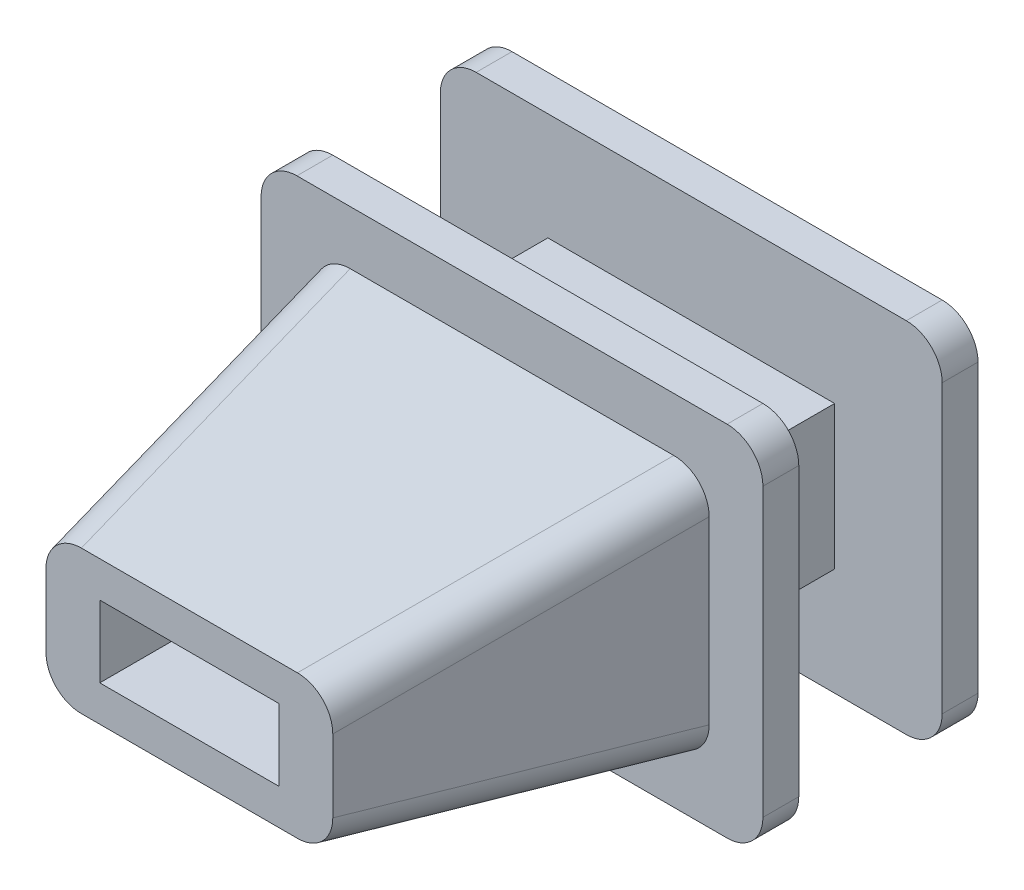
ISO-10303-21;
HEADER;
FILE_DESCRIPTION(('STEP AP214'),'2;1');
FILE_NAME('part.step','',(''),(''),'','','');
FILE_SCHEMA(('AUTOMOTIVE_DESIGN { 1 0 10303 214 1 1 1 1 }'));
ENDSEC;
DATA;
#1=APPLICATION_CONTEXT('core data for automotive mechanical design processes');
#2=APPLICATION_PROTOCOL_DEFINITION('international standard','automotive_design',2000,#1);
#3=PRODUCT_CONTEXT('',#1,'mechanical');
#4=PRODUCT('Part','Part','',(#3));
#5=PRODUCT_RELATED_PRODUCT_CATEGORY('part','',(#4));
#6=PRODUCT_DEFINITION_FORMATION('','',#4);
#7=PRODUCT_DEFINITION_CONTEXT('part definition',#1,'design');
#8=PRODUCT_DEFINITION('design','',#6,#7);
#9=PRODUCT_DEFINITION_SHAPE('','',#8);
#10=(LENGTH_UNIT() NAMED_UNIT(*) SI_UNIT(.MILLI.,.METRE.));
#11=(NAMED_UNIT(*) PLANE_ANGLE_UNIT() SI_UNIT($,.RADIAN.));
#12=(NAMED_UNIT(*) SI_UNIT($,.STERADIAN.) SOLID_ANGLE_UNIT());
#13=UNCERTAINTY_MEASURE_WITH_UNIT(LENGTH_MEASURE(1.E-05),#10,'distance_accuracy_value','');
#14=(GEOMETRIC_REPRESENTATION_CONTEXT(3) GLOBAL_UNCERTAINTY_ASSIGNED_CONTEXT((#13)) GLOBAL_UNIT_ASSIGNED_CONTEXT((#10,
#11,#12)) REPRESENTATION_CONTEXT('',''));
#15=CARTESIAN_POINT('',(0.,0.,0.));
#16=DIRECTION('',(0.,0.,1.));
#17=DIRECTION('',(1.,0.,0.));
#18=AXIS2_PLACEMENT_3D('',#15,#16,#17);
#19=CARTESIAN_POINT('',(-2.,1.,2.));
#20=DIRECTION('',(1.,0.,0.));
#21=DIRECTION('',(0.,1.,0.));
#22=AXIS2_PLACEMENT_3D('',#19,#20,#21);
#23=PLANE('',#22);
#24=DIRECTION('',(0.,-1.,0.));
#25=VECTOR('',#24,1.);
#26=CARTESIAN_POINT('',(-2.,1.,0.));
#27=LINE('',#26,#25);
#28=CARTESIAN_POINT('',(-2.,1.,0.));
#29=VERTEX_POINT('',#28);
#30=CARTESIAN_POINT('',(-2.,-1.,0.));
#31=VERTEX_POINT('',#30);
#32=EDGE_CURVE('E418',#29,#31,#27,.T.);
#33=ORIENTED_EDGE('',*,*,#32,.T.);
#34=DIRECTION('',(0.,0.,-1.));
#35=VECTOR('',#34,1.);
#36=CARTESIAN_POINT('',(-2.,-1.,2.));
#37=LINE('',#36,#35);
#38=CARTESIAN_POINT('',(-2.,-1.,2.));
#39=VERTEX_POINT('',#38);
#40=EDGE_CURVE('E451',#39,#31,#37,.T.);
#41=ORIENTED_EDGE('',*,*,#40,.F.);
#42=DIRECTION('',(0.,-1.,0.));
#43=VECTOR('',#42,1.);
#44=CARTESIAN_POINT('',(-2.,1.,2.));
#45=LINE('',#44,#43);
#46=CARTESIAN_POINT('',(-2.,1.,2.));
#47=VERTEX_POINT('',#46);
#48=EDGE_CURVE('E419',#47,#39,#45,.T.);
#49=ORIENTED_EDGE('',*,*,#48,.F.);
#50=DIRECTION('',(0.,0.,-1.));
#51=VECTOR('',#50,1.);
#52=CARTESIAN_POINT('',(-2.,1.,2.));
#53=LINE('',#52,#51);
#54=EDGE_CURVE('E432',#47,#29,#53,.T.);
#55=ORIENTED_EDGE('',*,*,#54,.T.);
#56=EDGE_LOOP('',(#33,#41,#49,#55));
#57=FACE_BOUND('',#56,.T.);
#58=ADVANCED_FACE('F34',(#57),#23,.F.);
#59=CARTESIAN_POINT('',(-2.,-1.,2.));
#60=DIRECTION('',(0.,1.,0.));
#61=DIRECTION('',(0.,0.,1.));
#62=AXIS2_PLACEMENT_3D('',#59,#60,#61);
#63=PLANE('',#62);
#64=DIRECTION('',(1.,0.,0.));
#65=VECTOR('',#64,1.);
#66=CARTESIAN_POINT('',(-2.,-1.,0.));
#67=LINE('',#66,#65);
#68=CARTESIAN_POINT('',(2.,-1.,0.));
#69=VERTEX_POINT('',#68);
#70=EDGE_CURVE('E435',#31,#69,#67,.T.);
#71=ORIENTED_EDGE('',*,*,#70,.T.);
#72=DIRECTION('',(0.,0.,-1.));
#73=VECTOR('',#72,1.);
#74=CARTESIAN_POINT('',(2.,-1.,2.));
#75=LINE('',#74,#73);
#76=CARTESIAN_POINT('',(2.,-1.,2.));
#77=VERTEX_POINT('',#76);
#78=EDGE_CURVE('E448',#77,#69,#75,.T.);
#79=ORIENTED_EDGE('',*,*,#78,.F.);
#80=DIRECTION('',(1.,0.,0.));
#81=VECTOR('',#80,1.);
#82=CARTESIAN_POINT('',(-2.,-1.,2.));
#83=LINE('',#82,#81);
#84=EDGE_CURVE('E422',#39,#77,#83,.T.);
#85=ORIENTED_EDGE('',*,*,#84,.F.);
#86=ORIENTED_EDGE('',*,*,#40,.T.);
#87=EDGE_LOOP('',(#71,#79,#85,#86));
#88=FACE_BOUND('',#87,.T.);
#89=ADVANCED_FACE('F535',(#88),#63,.F.);
#90=CARTESIAN_POINT('',(2.,1.,2.));
#91=DIRECTION('',(-1.,0.,0.));
#92=DIRECTION('',(0.,-1.,0.));
#93=AXIS2_PLACEMENT_3D('',#90,#91,#92);
#94=PLANE('',#93);
#95=DIRECTION('',(0.,1.,0.));
#96=VECTOR('',#95,1.);
#97=CARTESIAN_POINT('',(2.,1.,0.));
#98=LINE('',#97,#96);
#99=CARTESIAN_POINT('',(2.,1.,0.));
#100=VERTEX_POINT('',#99);
#101=EDGE_CURVE('E438',#69,#100,#98,.T.);
#102=ORIENTED_EDGE('',*,*,#101,.T.);
#103=DIRECTION('',(0.,0.,-1.));
#104=VECTOR('',#103,1.);
#105=CARTESIAN_POINT('',(2.,1.,2.));
#106=LINE('',#105,#104);
#107=CARTESIAN_POINT('',(2.,1.,2.));
#108=VERTEX_POINT('',#107);
#109=EDGE_CURVE('E445',#108,#100,#106,.T.);
#110=ORIENTED_EDGE('',*,*,#109,.F.);
#111=DIRECTION('',(0.,1.,0.));
#112=VECTOR('',#111,1.);
#113=CARTESIAN_POINT('',(2.,1.,2.));
#114=LINE('',#113,#112);
#115=EDGE_CURVE('E426',#77,#108,#114,.T.);
#116=ORIENTED_EDGE('',*,*,#115,.F.);
#117=ORIENTED_EDGE('',*,*,#78,.T.);
#118=EDGE_LOOP('',(#102,#110,#116,#117));
#119=FACE_BOUND('',#118,.T.);
#120=ADVANCED_FACE('F540',(#119),#94,.F.);
#121=CARTESIAN_POINT('',(-2.,1.,2.));
#122=DIRECTION('',(0.,-1.,0.));
#123=DIRECTION('',(0.,0.,-1.));
#124=AXIS2_PLACEMENT_3D('',#121,#122,#123);
#125=PLANE('',#124);
#126=DIRECTION('',(-1.,0.,0.));
#127=VECTOR('',#126,1.);
#128=CARTESIAN_POINT('',(-2.,1.,0.));
#129=LINE('',#128,#127);
#130=EDGE_CURVE('E423',#100,#29,#129,.T.);
#131=ORIENTED_EDGE('',*,*,#130,.T.);
#132=ORIENTED_EDGE('',*,*,#54,.F.);
#133=DIRECTION('',(-1.,0.,0.));
#134=VECTOR('',#133,1.);
#135=CARTESIAN_POINT('',(-2.,1.,2.));
#136=LINE('',#135,#134);
#137=EDGE_CURVE('E429',#108,#47,#136,.T.);
#138=ORIENTED_EDGE('',*,*,#137,.F.);
#139=ORIENTED_EDGE('',*,*,#109,.T.);
#140=EDGE_LOOP('',(#131,#132,#138,#139));
#141=FACE_BOUND('',#140,.T.);
#142=ADVANCED_FACE('F546',(#141),#125,.F.);
#143=CARTESIAN_POINT('',(-3.,-2.,0.));
#144=DIRECTION('',(0.,0.,-1.));
#145=DIRECTION('',(-1.,0.,0.));
#146=AXIS2_PLACEMENT_3D('',#143,#144,#145);
#147=PLANE('',#146);
#148=CARTESIAN_POINT('',(-3.,-2.,0.));
#149=DIRECTION('',(0.,0.,-1.));
#150=DIRECTION('',(-1.,0.,0.));
#151=AXIS2_PLACEMENT_3D('',#148,#149,#150);
#152=CIRCLE('',#151,0.499999999999999);
#153=CARTESIAN_POINT('',(-3.,-2.5,0.));
#154=VERTEX_POINT('',#153);
#155=CARTESIAN_POINT('',(-3.5,-2.,0.));
#156=VERTEX_POINT('',#155);
#157=EDGE_CURVE('E360',#154,#156,#152,.T.);
#158=ORIENTED_EDGE('',*,*,#157,.F.);
#159=DIRECTION('',(-1.,0.,0.));
#160=VECTOR('',#159,1.);
#161=CARTESIAN_POINT('',(3.,-2.5,0.));
#162=LINE('',#161,#160);
#163=CARTESIAN_POINT('',(3.,-2.5,0.));
#164=VERTEX_POINT('',#163);
#165=EDGE_CURVE('E365',#164,#154,#162,.T.);
#166=ORIENTED_EDGE('',*,*,#165,.F.);
#167=CARTESIAN_POINT('',(3.,-2.,0.));
#168=DIRECTION('',(0.,0.,-1.));
#169=DIRECTION('',(1.,0.,0.));
#170=AXIS2_PLACEMENT_3D('',#167,#168,#169);
#171=CIRCLE('',#170,0.499999999999999);
#172=CARTESIAN_POINT('',(3.5,-2.,0.));
#173=VERTEX_POINT('',#172);
#174=EDGE_CURVE('E392',#173,#164,#171,.T.);
#175=ORIENTED_EDGE('',*,*,#174,.F.);
#176=DIRECTION('',(0.,-1.,0.));
#177=VECTOR('',#176,1.);
#178=CARTESIAN_POINT('',(3.5,2.,0.));
#179=LINE('',#178,#177);
#180=CARTESIAN_POINT('',(3.5,2.,0.));
#181=VERTEX_POINT('',#180);
#182=EDGE_CURVE('E390',#181,#173,#179,.T.);
#183=ORIENTED_EDGE('',*,*,#182,.F.);
#184=CARTESIAN_POINT('',(3.,2.,0.));
#185=DIRECTION('',(0.,0.,-1.));
#186=DIRECTION('',(1.,0.,0.));
#187=AXIS2_PLACEMENT_3D('',#184,#185,#186);
#188=CIRCLE('',#187,0.5);
#189=CARTESIAN_POINT('',(3.,2.5,0.));
#190=VERTEX_POINT('',#189);
#191=EDGE_CURVE('E388',#190,#181,#188,.T.);
#192=ORIENTED_EDGE('',*,*,#191,.F.);
#193=DIRECTION('',(1.,0.,0.));
#194=VECTOR('',#193,1.);
#195=CARTESIAN_POINT('',(3.,2.5,0.));
#196=LINE('',#195,#194);
#197=CARTESIAN_POINT('',(-3.,2.5,0.));
#198=VERTEX_POINT('',#197);
#199=EDGE_CURVE('E386',#198,#190,#196,.T.);
#200=ORIENTED_EDGE('',*,*,#199,.F.);
#201=CARTESIAN_POINT('',(-3.,2.,0.));
#202=DIRECTION('',(0.,0.,-1.));
#203=DIRECTION('',(1.,0.,0.));
#204=AXIS2_PLACEMENT_3D('',#201,#202,#203);
#205=CIRCLE('',#204,0.5);
#206=CARTESIAN_POINT('',(-3.5,2.,0.));
#207=VERTEX_POINT('',#206);
#208=EDGE_CURVE('E384',#207,#198,#205,.T.);
#209=ORIENTED_EDGE('',*,*,#208,.F.);
#210=DIRECTION('',(0.,1.,0.));
#211=VECTOR('',#210,1.);
#212=CARTESIAN_POINT('',(-3.5,2.,0.));
#213=LINE('',#212,#211);
#214=EDGE_CURVE('E382',#156,#207,#213,.T.);
#215=ORIENTED_EDGE('',*,*,#214,.F.);
#216=EDGE_LOOP('',(#158,#166,#175,#183,#192,#200,#209,#215));
#217=FACE_BOUND('',#216,.T.);
#218=ORIENTED_EDGE('',*,*,#70,.F.);
#219=ORIENTED_EDGE('',*,*,#32,.F.);
#220=ORIENTED_EDGE('',*,*,#130,.F.);
#221=ORIENTED_EDGE('',*,*,#101,.F.);
#222=EDGE_LOOP('',(#218,#219,#220,#221));
#223=FACE_BOUND('',#222,.T.);
#224=ADVANCED_FACE('F550',(#217,#223),#147,.F.);
#225=CARTESIAN_POINT('',(-3.,-2.,-0.5));
#226=DIRECTION('',(0.,0.,1.));
#227=DIRECTION('',(1.,0.,0.));
#228=AXIS2_PLACEMENT_3D('',#225,#226,#227);
#229=CYLINDRICAL_SURFACE('',#228,0.499999999999999);
#230=ORIENTED_EDGE('',*,*,#157,.T.);
#231=DIRECTION('',(0.,0.,1.));
#232=VECTOR('',#231,1.);
#233=CARTESIAN_POINT('',(-3.5,-2.,-0.5));
#234=LINE('',#233,#232);
#235=CARTESIAN_POINT('',(-3.5,-2.,-0.5));
#236=VERTEX_POINT('',#235);
#237=EDGE_CURVE('E415',#236,#156,#234,.T.);
#238=ORIENTED_EDGE('',*,*,#237,.F.);
#239=CARTESIAN_POINT('',(-3.,-2.,-0.5));
#240=DIRECTION('',(0.,0.,-1.));
#241=DIRECTION('',(-1.,0.,0.));
#242=AXIS2_PLACEMENT_3D('',#239,#240,#241);
#243=CIRCLE('',#242,0.499999999999999);
#244=CARTESIAN_POINT('',(-3.,-2.5,-0.5));
#245=VERTEX_POINT('',#244);
#246=EDGE_CURVE('E361',#245,#236,#243,.T.);
#247=ORIENTED_EDGE('',*,*,#246,.F.);
#248=DIRECTION('',(0.,0.,1.));
#249=VECTOR('',#248,1.);
#250=CARTESIAN_POINT('',(-3.,-2.5,-0.5));
#251=LINE('',#250,#249);
#252=EDGE_CURVE('E379',#245,#154,#251,.T.);
#253=ORIENTED_EDGE('',*,*,#252,.T.);
#254=EDGE_LOOP('',(#230,#238,#247,#253));
#255=FACE_BOUND('',#254,.T.);
#256=ADVANCED_FACE('F552',(#255),#229,.T.);
#257=CARTESIAN_POINT('',(-3.5,2.,-0.5));
#258=DIRECTION('',(1.,0.,0.));
#259=DIRECTION('',(0.,1.,0.));
#260=AXIS2_PLACEMENT_3D('',#257,#258,#259);
#261=PLANE('',#260);
#262=ORIENTED_EDGE('',*,*,#214,.T.);
#263=DIRECTION('',(0.,0.,1.));
#264=VECTOR('',#263,1.);
#265=CARTESIAN_POINT('',(-3.5,2.,-0.5));
#266=LINE('',#265,#264);
#267=CARTESIAN_POINT('',(-3.5,2.,-0.5));
#268=VERTEX_POINT('',#267);
#269=EDGE_CURVE('E412',#268,#207,#266,.T.);
#270=ORIENTED_EDGE('',*,*,#269,.F.);
#271=DIRECTION('',(0.,1.,0.));
#272=VECTOR('',#271,1.);
#273=CARTESIAN_POINT('',(-3.5,2.,-0.5));
#274=LINE('',#273,#272);
#275=EDGE_CURVE('E364',#236,#268,#274,.T.);
#276=ORIENTED_EDGE('',*,*,#275,.F.);
#277=ORIENTED_EDGE('',*,*,#237,.T.);
#278=EDGE_LOOP('',(#262,#270,#276,#277));
#279=FACE_BOUND('',#278,.T.);
#280=ADVANCED_FACE('F555',(#279),#261,.F.);
#281=CARTESIAN_POINT('',(-3.,2.,-0.5));
#282=DIRECTION('',(0.,0.,1.));
#283=DIRECTION('',(1.,0.,0.));
#284=AXIS2_PLACEMENT_3D('',#281,#282,#283);
#285=CYLINDRICAL_SURFACE('',#284,0.5);
#286=ORIENTED_EDGE('',*,*,#208,.T.);
#287=DIRECTION('',(0.,0.,1.));
#288=VECTOR('',#287,1.);
#289=CARTESIAN_POINT('',(-3.,2.5,-0.5));
#290=LINE('',#289,#288);
#291=CARTESIAN_POINT('',(-3.,2.5,-0.5));
#292=VERTEX_POINT('',#291);
#293=EDGE_CURVE('E409',#292,#198,#290,.T.);
#294=ORIENTED_EDGE('',*,*,#293,.F.);
#295=CARTESIAN_POINT('',(-3.,2.,-0.5));
#296=DIRECTION('',(0.,0.,-1.));
#297=DIRECTION('',(1.,0.,0.));
#298=AXIS2_PLACEMENT_3D('',#295,#296,#297);
#299=CIRCLE('',#298,0.5);
#300=EDGE_CURVE('E367',#268,#292,#299,.T.);
#301=ORIENTED_EDGE('',*,*,#300,.F.);
#302=ORIENTED_EDGE('',*,*,#269,.T.);
#303=EDGE_LOOP('',(#286,#294,#301,#302));
#304=FACE_BOUND('',#303,.T.);
#305=ADVANCED_FACE('F559',(#304),#285,.T.);
#306=CARTESIAN_POINT('',(3.,2.5,-0.5));
#307=DIRECTION('',(0.,-1.,0.));
#308=DIRECTION('',(1.,0.,0.));
#309=AXIS2_PLACEMENT_3D('',#306,#307,#308);
#310=PLANE('',#309);
#311=ORIENTED_EDGE('',*,*,#199,.T.);
#312=DIRECTION('',(0.,0.,1.));
#313=VECTOR('',#312,1.);
#314=CARTESIAN_POINT('',(3.,2.5,-0.5));
#315=LINE('',#314,#313);
#316=CARTESIAN_POINT('',(3.,2.5,-0.5));
#317=VERTEX_POINT('',#316);
#318=EDGE_CURVE('E406',#317,#190,#315,.T.);
#319=ORIENTED_EDGE('',*,*,#318,.F.);
#320=DIRECTION('',(1.,0.,0.));
#321=VECTOR('',#320,1.);
#322=CARTESIAN_POINT('',(3.,2.5,-0.5));
#323=LINE('',#322,#321);
#324=EDGE_CURVE('E369',#292,#317,#323,.T.);
#325=ORIENTED_EDGE('',*,*,#324,.F.);
#326=ORIENTED_EDGE('',*,*,#293,.T.);
#327=EDGE_LOOP('',(#311,#319,#325,#326));
#328=FACE_BOUND('',#327,.T.);
#329=ADVANCED_FACE('F563',(#328),#310,.F.);
#330=CARTESIAN_POINT('',(3.,2.,-0.5));
#331=DIRECTION('',(0.,0.,1.));
#332=DIRECTION('',(1.,0.,0.));
#333=AXIS2_PLACEMENT_3D('',#330,#331,#332);
#334=CYLINDRICAL_SURFACE('',#333,0.5);
#335=ORIENTED_EDGE('',*,*,#191,.T.);
#336=DIRECTION('',(0.,0.,1.));
#337=VECTOR('',#336,1.);
#338=CARTESIAN_POINT('',(3.5,2.,-0.5));
#339=LINE('',#338,#337);
#340=CARTESIAN_POINT('',(3.5,2.,-0.5));
#341=VERTEX_POINT('',#340);
#342=EDGE_CURVE('E403',#341,#181,#339,.T.);
#343=ORIENTED_EDGE('',*,*,#342,.F.);
#344=CARTESIAN_POINT('',(3.,2.,-0.5));
#345=DIRECTION('',(0.,0.,-1.));
#346=DIRECTION('',(1.,0.,0.));
#347=AXIS2_PLACEMENT_3D('',#344,#345,#346);
#348=CIRCLE('',#347,0.5);
#349=EDGE_CURVE('E371',#317,#341,#348,.T.);
#350=ORIENTED_EDGE('',*,*,#349,.F.);
#351=ORIENTED_EDGE('',*,*,#318,.T.);
#352=EDGE_LOOP('',(#335,#343,#350,#351));
#353=FACE_BOUND('',#352,.T.);
#354=ADVANCED_FACE('F567',(#353),#334,.T.);
#355=CARTESIAN_POINT('',(3.5,2.,-0.5));
#356=DIRECTION('',(-1.,0.,0.));
#357=DIRECTION('',(0.,-1.,0.));
#358=AXIS2_PLACEMENT_3D('',#355,#356,#357);
#359=PLANE('',#358);
#360=ORIENTED_EDGE('',*,*,#182,.T.);
#361=DIRECTION('',(0.,0.,1.));
#362=VECTOR('',#361,1.);
#363=CARTESIAN_POINT('',(3.5,-2.,-0.5));
#364=LINE('',#363,#362);
#365=CARTESIAN_POINT('',(3.5,-2.,-0.5));
#366=VERTEX_POINT('',#365);
#367=EDGE_CURVE('E400',#366,#173,#364,.T.);
#368=ORIENTED_EDGE('',*,*,#367,.F.);
#369=DIRECTION('',(0.,-1.,0.));
#370=VECTOR('',#369,1.);
#371=CARTESIAN_POINT('',(3.5,2.,-0.5));
#372=LINE('',#371,#370);
#373=EDGE_CURVE('E373',#341,#366,#372,.T.);
#374=ORIENTED_EDGE('',*,*,#373,.F.);
#375=ORIENTED_EDGE('',*,*,#342,.T.);
#376=EDGE_LOOP('',(#360,#368,#374,#375));
#377=FACE_BOUND('',#376,.T.);
#378=ADVANCED_FACE('F571',(#377),#359,.F.);
#379=CARTESIAN_POINT('',(3.,-2.,-0.5));
#380=DIRECTION('',(0.,0.,1.));
#381=DIRECTION('',(1.,0.,0.));
#382=AXIS2_PLACEMENT_3D('',#379,#380,#381);
#383=CYLINDRICAL_SURFACE('',#382,0.499999999999999);
#384=ORIENTED_EDGE('',*,*,#174,.T.);
#385=DIRECTION('',(0.,0.,1.));
#386=VECTOR('',#385,1.);
#387=CARTESIAN_POINT('',(3.,-2.5,-0.5));
#388=LINE('',#387,#386);
#389=CARTESIAN_POINT('',(3.,-2.5,-0.5));
#390=VERTEX_POINT('',#389);
#391=EDGE_CURVE('E397',#390,#164,#388,.T.);
#392=ORIENTED_EDGE('',*,*,#391,.F.);
#393=CARTESIAN_POINT('',(3.,-2.,-0.5));
#394=DIRECTION('',(0.,0.,-1.));
#395=DIRECTION('',(1.,0.,0.));
#396=AXIS2_PLACEMENT_3D('',#393,#394,#395);
#397=CIRCLE('',#396,0.499999999999999);
#398=EDGE_CURVE('E375',#366,#390,#397,.T.);
#399=ORIENTED_EDGE('',*,*,#398,.F.);
#400=ORIENTED_EDGE('',*,*,#367,.T.);
#401=EDGE_LOOP('',(#384,#392,#399,#400));
#402=FACE_BOUND('',#401,.T.);
#403=ADVANCED_FACE('F575',(#402),#383,.T.);
#404=CARTESIAN_POINT('',(3.,-2.5,-0.5));
#405=DIRECTION('',(0.,1.,0.));
#406=DIRECTION('',(0.,0.,1.));
#407=AXIS2_PLACEMENT_3D('',#404,#405,#406);
#408=PLANE('',#407);
#409=ORIENTED_EDGE('',*,*,#165,.T.);
#410=ORIENTED_EDGE('',*,*,#252,.F.);
#411=DIRECTION('',(-1.,0.,0.));
#412=VECTOR('',#411,1.);
#413=CARTESIAN_POINT('',(3.,-2.5,-0.5));
#414=LINE('',#413,#412);
#415=EDGE_CURVE('E377',#390,#245,#414,.T.);
#416=ORIENTED_EDGE('',*,*,#415,.F.);
#417=ORIENTED_EDGE('',*,*,#391,.T.);
#418=EDGE_LOOP('',(#409,#410,#416,#417));
#419=FACE_BOUND('',#418,.T.);
#420=ADVANCED_FACE('F579',(#419),#408,.F.);
#421=CARTESIAN_POINT('',(-3.,-2.,-0.5));
#422=DIRECTION('',(0.,0.,-1.));
#423=DIRECTION('',(-1.,0.,0.));
#424=AXIS2_PLACEMENT_3D('',#421,#422,#423);
#425=PLANE('',#424);
#426=DIRECTION('',(0.,-1.,0.));
#427=VECTOR('',#426,1.);
#428=CARTESIAN_POINT('',(-1.25,0.5,-0.5));
#429=LINE('',#428,#427);
#430=CARTESIAN_POINT('',(-1.25,0.5,-0.5));
#431=VERTEX_POINT('',#430);
#432=CARTESIAN_POINT('',(-1.25,-0.5,-0.5));
#433=VERTEX_POINT('',#432);
#434=EDGE_CURVE('E244',#431,#433,#429,.T.);
#435=ORIENTED_EDGE('',*,*,#434,.T.);
#436=DIRECTION('',(1.,0.,0.));
#437=VECTOR('',#436,1.);
#438=CARTESIAN_POINT('',(-1.25,-0.5,-0.5));
#439=LINE('',#438,#437);
#440=CARTESIAN_POINT('',(1.25,-0.5,-0.5));
#441=VERTEX_POINT('',#440);
#442=EDGE_CURVE('E253',#433,#441,#439,.T.);
#443=ORIENTED_EDGE('',*,*,#442,.T.);
#444=DIRECTION('',(0.,1.,0.));
#445=VECTOR('',#444,1.);
#446=CARTESIAN_POINT('',(1.25,0.5,-0.5));
#447=LINE('',#446,#445);
#448=CARTESIAN_POINT('',(1.25,0.5,-0.5));
#449=VERTEX_POINT('',#448);
#450=EDGE_CURVE('E49',#441,#449,#447,.T.);
#451=ORIENTED_EDGE('',*,*,#450,.T.);
#452=DIRECTION('',(-1.,0.,0.));
#453=VECTOR('',#452,1.);
#454=CARTESIAN_POINT('',(-1.25,0.5,-0.5));
#455=LINE('',#454,#453);
#456=EDGE_CURVE('E250',#449,#431,#455,.T.);
#457=ORIENTED_EDGE('',*,*,#456,.T.);
#458=EDGE_LOOP('',(#435,#443,#451,#457));
#459=FACE_BOUND('',#458,.T.);
#460=ORIENTED_EDGE('',*,*,#246,.T.);
#461=ORIENTED_EDGE('',*,*,#275,.T.);
#462=ORIENTED_EDGE('',*,*,#300,.T.);
#463=ORIENTED_EDGE('',*,*,#324,.T.);
#464=ORIENTED_EDGE('',*,*,#349,.T.);
#465=ORIENTED_EDGE('',*,*,#373,.T.);
#466=ORIENTED_EDGE('',*,*,#398,.T.);
#467=ORIENTED_EDGE('',*,*,#415,.T.);
#468=EDGE_LOOP('',(#460,#461,#462,#463,#464,#465,#466,#467));
#469=FACE_BOUND('',#468,.T.);
#470=ADVANCED_FACE('F257',(#459,#469),#425,.T.);
#471=CARTESIAN_POINT('',(-3.,-2.,2.));
#472=DIRECTION('',(0.,0.,1.));
#473=DIRECTION('',(1.,0.,0.));
#474=AXIS2_PLACEMENT_3D('',#471,#472,#473);
#475=PLANE('',#474);
#476=CARTESIAN_POINT('',(-3.,-2.,2.));
#477=DIRECTION('',(0.,0.,1.));
#478=DIRECTION('',(1.,0.,0.));
#479=AXIS2_PLACEMENT_3D('',#476,#477,#478);
#480=CIRCLE('',#479,0.499999999999999);
#481=CARTESIAN_POINT('',(-3.5,-2.,2.));
#482=VERTEX_POINT('',#481);
#483=CARTESIAN_POINT('',(-3.,-2.5,2.));
#484=VERTEX_POINT('',#483);
#485=EDGE_CURVE('E290',#482,#484,#480,.T.);
#486=ORIENTED_EDGE('',*,*,#485,.F.);
#487=DIRECTION('',(0.,-1.,0.));
#488=VECTOR('',#487,1.);
#489=CARTESIAN_POINT('',(-3.5,2.,2.));
#490=LINE('',#489,#488);
#491=CARTESIAN_POINT('',(-3.5,2.,2.));
#492=VERTEX_POINT('',#491);
#493=EDGE_CURVE('E307',#492,#482,#490,.T.);
#494=ORIENTED_EDGE('',*,*,#493,.F.);
#495=CARTESIAN_POINT('',(-3.,2.,2.));
#496=DIRECTION('',(0.,0.,1.));
#497=DIRECTION('',(1.,0.,0.));
#498=AXIS2_PLACEMENT_3D('',#495,#496,#497);
#499=CIRCLE('',#498,0.5);
#500=CARTESIAN_POINT('',(-3.,2.5,2.));
#501=VERTEX_POINT('',#500);
#502=EDGE_CURVE('E334',#501,#492,#499,.T.);
#503=ORIENTED_EDGE('',*,*,#502,.F.);
#504=DIRECTION('',(-1.,0.,0.));
#505=VECTOR('',#504,1.);
#506=CARTESIAN_POINT('',(3.,2.5,2.));
#507=LINE('',#506,#505);
#508=CARTESIAN_POINT('',(3.,2.5,2.));
#509=VERTEX_POINT('',#508);
#510=EDGE_CURVE('E332',#509,#501,#507,.T.);
#511=ORIENTED_EDGE('',*,*,#510,.F.);
#512=CARTESIAN_POINT('',(3.,2.,2.));
#513=DIRECTION('',(0.,0.,1.));
#514=DIRECTION('',(1.,0.,0.));
#515=AXIS2_PLACEMENT_3D('',#512,#513,#514);
#516=CIRCLE('',#515,0.5);
#517=CARTESIAN_POINT('',(3.5,2.,2.));
#518=VERTEX_POINT('',#517);
#519=EDGE_CURVE('E330',#518,#509,#516,.T.);
#520=ORIENTED_EDGE('',*,*,#519,.F.);
#521=DIRECTION('',(0.,1.,0.));
#522=VECTOR('',#521,1.);
#523=CARTESIAN_POINT('',(3.5,-2.,2.));
#524=LINE('',#523,#522);
#525=CARTESIAN_POINT('',(3.5,-2.,2.));
#526=VERTEX_POINT('',#525);
#527=EDGE_CURVE('E328',#526,#518,#524,.T.);
#528=ORIENTED_EDGE('',*,*,#527,.F.);
#529=CARTESIAN_POINT('',(3.,-2.,2.));
#530=DIRECTION('',(0.,0.,1.));
#531=DIRECTION('',(1.,0.,0.));
#532=AXIS2_PLACEMENT_3D('',#529,#530,#531);
#533=CIRCLE('',#532,0.499999999999999);
#534=CARTESIAN_POINT('',(3.,-2.5,2.));
#535=VERTEX_POINT('',#534);
#536=EDGE_CURVE('E326',#535,#526,#533,.T.);
#537=ORIENTED_EDGE('',*,*,#536,.F.);
#538=DIRECTION('',(1.,0.,0.));
#539=VECTOR('',#538,1.);
#540=CARTESIAN_POINT('',(-3.,-2.5,2.));
#541=LINE('',#540,#539);
#542=EDGE_CURVE('E324',#484,#535,#541,.T.);
#543=ORIENTED_EDGE('',*,*,#542,.F.);
#544=EDGE_LOOP('',(#486,#494,#503,#511,#520,#528,#537,#543));
#545=FACE_BOUND('',#544,.T.);
#546=ORIENTED_EDGE('',*,*,#137,.T.);
#547=ORIENTED_EDGE('',*,*,#48,.T.);
#548=ORIENTED_EDGE('',*,*,#84,.T.);
#549=ORIENTED_EDGE('',*,*,#115,.T.);
#550=EDGE_LOOP('',(#546,#547,#548,#549));
#551=FACE_BOUND('',#550,.T.);
#552=ADVANCED_FACE('F589',(#545,#551),#475,.F.);
#553=CARTESIAN_POINT('',(-3.,-2.,2.5));
#554=DIRECTION('',(0.,0.,-1.));
#555=DIRECTION('',(-1.,0.,0.));
#556=AXIS2_PLACEMENT_3D('',#553,#554,#555);
#557=CYLINDRICAL_SURFACE('',#556,0.499999999999999);
#558=ORIENTED_EDGE('',*,*,#485,.T.);
#559=DIRECTION('',(0.,0.,-1.));
#560=VECTOR('',#559,1.);
#561=CARTESIAN_POINT('',(-3.,-2.5,2.5));
#562=LINE('',#561,#560);
#563=CARTESIAN_POINT('',(-3.,-2.5,2.5));
#564=VERTEX_POINT('',#563);
#565=EDGE_CURVE('E357',#564,#484,#562,.T.);
#566=ORIENTED_EDGE('',*,*,#565,.F.);
#567=CARTESIAN_POINT('',(-3.,-2.,2.5));
#568=DIRECTION('',(0.,0.,1.));
#569=DIRECTION('',(1.,0.,0.));
#570=AXIS2_PLACEMENT_3D('',#567,#568,#569);
#571=CIRCLE('',#570,0.499999999999999);
#572=CARTESIAN_POINT('',(-3.5,-2.,2.5));
#573=VERTEX_POINT('',#572);
#574=EDGE_CURVE('E303',#573,#564,#571,.T.);
#575=ORIENTED_EDGE('',*,*,#574,.F.);
#576=DIRECTION('',(0.,0.,-1.));
#577=VECTOR('',#576,1.);
#578=CARTESIAN_POINT('',(-3.5,-2.,2.5));
#579=LINE('',#578,#577);
#580=EDGE_CURVE('E321',#573,#482,#579,.T.);
#581=ORIENTED_EDGE('',*,*,#580,.T.);
#582=EDGE_LOOP('',(#558,#566,#575,#581));
#583=FACE_BOUND('',#582,.T.);
#584=ADVANCED_FACE('F590',(#583),#557,.T.);
#585=CARTESIAN_POINT('',(-3.,-2.5,2.5));
#586=DIRECTION('',(0.,1.,0.));
#587=DIRECTION('',(0.,0.,1.));
#588=AXIS2_PLACEMENT_3D('',#585,#586,#587);
#589=PLANE('',#588);
#590=ORIENTED_EDGE('',*,*,#542,.T.);
#591=DIRECTION('',(0.,0.,-1.));
#592=VECTOR('',#591,1.);
#593=CARTESIAN_POINT('',(3.,-2.5,2.5));
#594=LINE('',#593,#592);
#595=CARTESIAN_POINT('',(3.,-2.5,2.5));
#596=VERTEX_POINT('',#595);
#597=EDGE_CURVE('E354',#596,#535,#594,.T.);
#598=ORIENTED_EDGE('',*,*,#597,.F.);
#599=DIRECTION('',(1.,0.,0.));
#600=VECTOR('',#599,1.);
#601=CARTESIAN_POINT('',(-3.,-2.5,2.5));
#602=LINE('',#601,#600);
#603=EDGE_CURVE('E306',#564,#596,#602,.T.);
#604=ORIENTED_EDGE('',*,*,#603,.F.);
#605=ORIENTED_EDGE('',*,*,#565,.T.);
#606=EDGE_LOOP('',(#590,#598,#604,#605));
#607=FACE_BOUND('',#606,.T.);
#608=ADVANCED_FACE('F593',(#607),#589,.F.);
#609=CARTESIAN_POINT('',(3.,-2.,2.5));
#610=DIRECTION('',(0.,0.,-1.));
#611=DIRECTION('',(-1.,0.,0.));
#612=AXIS2_PLACEMENT_3D('',#609,#610,#611);
#613=CYLINDRICAL_SURFACE('',#612,0.499999999999999);
#614=ORIENTED_EDGE('',*,*,#536,.T.);
#615=DIRECTION('',(0.,0.,-1.));
#616=VECTOR('',#615,1.);
#617=CARTESIAN_POINT('',(3.5,-2.,2.5));
#618=LINE('',#617,#616);
#619=CARTESIAN_POINT('',(3.5,-2.,2.5));
#620=VERTEX_POINT('',#619);
#621=EDGE_CURVE('E351',#620,#526,#618,.T.);
#622=ORIENTED_EDGE('',*,*,#621,.F.);
#623=CARTESIAN_POINT('',(3.,-2.,2.5));
#624=DIRECTION('',(0.,0.,1.));
#625=DIRECTION('',(1.,0.,0.));
#626=AXIS2_PLACEMENT_3D('',#623,#624,#625);
#627=CIRCLE('',#626,0.499999999999999);
#628=EDGE_CURVE('E309',#596,#620,#627,.T.);
#629=ORIENTED_EDGE('',*,*,#628,.F.);
#630=ORIENTED_EDGE('',*,*,#597,.T.);
#631=EDGE_LOOP('',(#614,#622,#629,#630));
#632=FACE_BOUND('',#631,.T.);
#633=ADVANCED_FACE('F597',(#632),#613,.T.);
#634=CARTESIAN_POINT('',(3.5,-2.,2.5));
#635=DIRECTION('',(-1.,0.,0.));
#636=DIRECTION('',(0.,-1.,0.));
#637=AXIS2_PLACEMENT_3D('',#634,#635,#636);
#638=PLANE('',#637);
#639=ORIENTED_EDGE('',*,*,#527,.T.);
#640=DIRECTION('',(0.,0.,-1.));
#641=VECTOR('',#640,1.);
#642=CARTESIAN_POINT('',(3.5,2.,2.5));
#643=LINE('',#642,#641);
#644=CARTESIAN_POINT('',(3.5,2.,2.5));
#645=VERTEX_POINT('',#644);
#646=EDGE_CURVE('E348',#645,#518,#643,.T.);
#647=ORIENTED_EDGE('',*,*,#646,.F.);
#648=DIRECTION('',(0.,1.,0.));
#649=VECTOR('',#648,1.);
#650=CARTESIAN_POINT('',(3.5,-2.,2.5));
#651=LINE('',#650,#649);
#652=EDGE_CURVE('E311',#620,#645,#651,.T.);
#653=ORIENTED_EDGE('',*,*,#652,.F.);
#654=ORIENTED_EDGE('',*,*,#621,.T.);
#655=EDGE_LOOP('',(#639,#647,#653,#654));
#656=FACE_BOUND('',#655,.T.);
#657=ADVANCED_FACE('F601',(#656),#638,.F.);
#658=CARTESIAN_POINT('',(3.,2.,2.5));
#659=DIRECTION('',(0.,0.,-1.));
#660=DIRECTION('',(-1.,0.,0.));
#661=AXIS2_PLACEMENT_3D('',#658,#659,#660);
#662=CYLINDRICAL_SURFACE('',#661,0.5);
#663=ORIENTED_EDGE('',*,*,#519,.T.);
#664=DIRECTION('',(0.,0.,-1.));
#665=VECTOR('',#664,1.);
#666=CARTESIAN_POINT('',(3.,2.5,2.5));
#667=LINE('',#666,#665);
#668=CARTESIAN_POINT('',(3.,2.5,2.5));
#669=VERTEX_POINT('',#668);
#670=EDGE_CURVE('E345',#669,#509,#667,.T.);
#671=ORIENTED_EDGE('',*,*,#670,.F.);
#672=CARTESIAN_POINT('',(3.,2.,2.5));
#673=DIRECTION('',(0.,0.,1.));
#674=DIRECTION('',(1.,0.,0.));
#675=AXIS2_PLACEMENT_3D('',#672,#673,#674);
#676=CIRCLE('',#675,0.5);
#677=EDGE_CURVE('E313',#645,#669,#676,.T.);
#678=ORIENTED_EDGE('',*,*,#677,.F.);
#679=ORIENTED_EDGE('',*,*,#646,.T.);
#680=EDGE_LOOP('',(#663,#671,#678,#679));
#681=FACE_BOUND('',#680,.T.);
#682=ADVANCED_FACE('F605',(#681),#662,.T.);
#683=CARTESIAN_POINT('',(3.,2.5,2.5));
#684=DIRECTION('',(0.,-1.,0.));
#685=DIRECTION('',(1.,0.,0.));
#686=AXIS2_PLACEMENT_3D('',#683,#684,#685);
#687=PLANE('',#686);
#688=ORIENTED_EDGE('',*,*,#510,.T.);
#689=DIRECTION('',(0.,0.,-1.));
#690=VECTOR('',#689,1.);
#691=CARTESIAN_POINT('',(-3.,2.5,2.5));
#692=LINE('',#691,#690);
#693=CARTESIAN_POINT('',(-3.,2.5,2.5));
#694=VERTEX_POINT('',#693);
#695=EDGE_CURVE('E342',#694,#501,#692,.T.);
#696=ORIENTED_EDGE('',*,*,#695,.F.);
#697=DIRECTION('',(-1.,0.,0.));
#698=VECTOR('',#697,1.);
#699=CARTESIAN_POINT('',(3.,2.5,2.5));
#700=LINE('',#699,#698);
#701=EDGE_CURVE('E315',#669,#694,#700,.T.);
#702=ORIENTED_EDGE('',*,*,#701,.F.);
#703=ORIENTED_EDGE('',*,*,#670,.T.);
#704=EDGE_LOOP('',(#688,#696,#702,#703));
#705=FACE_BOUND('',#704,.T.);
#706=ADVANCED_FACE('F609',(#705),#687,.F.);
#707=CARTESIAN_POINT('',(-3.,2.,2.5));
#708=DIRECTION('',(0.,0.,-1.));
#709=DIRECTION('',(-1.,0.,0.));
#710=AXIS2_PLACEMENT_3D('',#707,#708,#709);
#711=CYLINDRICAL_SURFACE('',#710,0.5);
#712=ORIENTED_EDGE('',*,*,#502,.T.);
#713=DIRECTION('',(0.,0.,-1.));
#714=VECTOR('',#713,1.);
#715=CARTESIAN_POINT('',(-3.5,2.,2.5));
#716=LINE('',#715,#714);
#717=CARTESIAN_POINT('',(-3.5,2.,2.5));
#718=VERTEX_POINT('',#717);
#719=EDGE_CURVE('E339',#718,#492,#716,.T.);
#720=ORIENTED_EDGE('',*,*,#719,.F.);
#721=CARTESIAN_POINT('',(-3.,2.,2.5));
#722=DIRECTION('',(0.,0.,1.));
#723=DIRECTION('',(1.,0.,0.));
#724=AXIS2_PLACEMENT_3D('',#721,#722,#723);
#725=CIRCLE('',#724,0.5);
#726=EDGE_CURVE('E317',#694,#718,#725,.T.);
#727=ORIENTED_EDGE('',*,*,#726,.F.);
#728=ORIENTED_EDGE('',*,*,#695,.T.);
#729=EDGE_LOOP('',(#712,#720,#727,#728));
#730=FACE_BOUND('',#729,.T.);
#731=ADVANCED_FACE('F613',(#730),#711,.T.);
#732=CARTESIAN_POINT('',(-3.5,2.,2.5));
#733=DIRECTION('',(1.,0.,0.));
#734=DIRECTION('',(0.,1.,0.));
#735=AXIS2_PLACEMENT_3D('',#732,#733,#734);
#736=PLANE('',#735);
#737=ORIENTED_EDGE('',*,*,#493,.T.);
#738=ORIENTED_EDGE('',*,*,#580,.F.);
#739=DIRECTION('',(0.,-1.,0.));
#740=VECTOR('',#739,1.);
#741=CARTESIAN_POINT('',(-3.5,2.,2.5));
#742=LINE('',#741,#740);
#743=EDGE_CURVE('E319',#718,#573,#742,.T.);
#744=ORIENTED_EDGE('',*,*,#743,.F.);
#745=ORIENTED_EDGE('',*,*,#719,.T.);
#746=EDGE_LOOP('',(#737,#738,#744,#745));
#747=FACE_BOUND('',#746,.T.);
#748=ADVANCED_FACE('F617',(#747),#736,.F.);
#749=CARTESIAN_POINT('',(-3.,-2.,2.5));
#750=DIRECTION('',(0.,0.,1.));
#751=DIRECTION('',(1.,0.,0.));
#752=AXIS2_PLACEMENT_3D('',#749,#750,#751);
#753=PLANE('',#752);
#754=DIRECTION('',(0.,-1.,0.));
#755=VECTOR('',#754,1.);
#756=CARTESIAN_POINT('',(-2.75,1.75,2.5));
#757=LINE('',#756,#755);
#758=CARTESIAN_POINT('',(-2.75,1.25680303808393,2.5));
#759=VERTEX_POINT('',#758);
#760=CARTESIAN_POINT('',(-2.75,-1.25680303808393,2.5));
#761=VERTEX_POINT('',#760);
#762=EDGE_CURVE('E283',#759,#761,#757,.T.);
#763=ORIENTED_EDGE('',*,*,#762,.F.);
#764=CARTESIAN_POINT('',(-2.24310312247515,1.24310312247515,2.5));
#765=DIRECTION('',(0.,0.,1.));
#766=DIRECTION('',(0.707106781186548,-0.707106781186547,0.));
#767=AXIS2_PLACEMENT_3D('',#764,#765,#766);
#768=ELLIPSE('',#767,0.513701166914081,0.5);
#769=CARTESIAN_POINT('',(-2.25680303808393,1.75,2.5));
#770=VERTEX_POINT('',#769);
#771=EDGE_CURVE('E42',#759,#770,#768,.F.);
#772=ORIENTED_EDGE('',*,*,#771,.T.);
#773=DIRECTION('',(-1.,0.,0.));
#774=VECTOR('',#773,1.);
#775=CARTESIAN_POINT('',(-2.75,1.75,2.5));
#776=LINE('',#775,#774);
#777=CARTESIAN_POINT('',(2.25680303808393,1.75,2.5));
#778=VERTEX_POINT('',#777);
#779=EDGE_CURVE('E287',#778,#770,#776,.T.);
#780=ORIENTED_EDGE('',*,*,#779,.F.);
#781=CARTESIAN_POINT('',(2.24310312247515,1.24310312247515,2.5));
#782=DIRECTION('',(0.,0.,1.));
#783=DIRECTION('',(-0.707106781186547,-0.707106781186548,0.));
#784=AXIS2_PLACEMENT_3D('',#781,#782,#783);
#785=ELLIPSE('',#784,0.513701166914081,0.5);
#786=CARTESIAN_POINT('',(2.75,1.25680303808393,2.5));
#787=VERTEX_POINT('',#786);
#788=EDGE_CURVE('E482',#778,#787,#785,.F.);
#789=ORIENTED_EDGE('',*,*,#788,.T.);
#790=DIRECTION('',(0.,1.,0.));
#791=VECTOR('',#790,1.);
#792=CARTESIAN_POINT('',(2.75,1.75,2.5));
#793=LINE('',#792,#791);
#794=CARTESIAN_POINT('',(2.75,-1.25680303808393,2.5));
#795=VERTEX_POINT('',#794);
#796=EDGE_CURVE('E282',#795,#787,#793,.T.);
#797=ORIENTED_EDGE('',*,*,#796,.F.);
#798=CARTESIAN_POINT('',(2.24310312247515,-1.24310312247515,2.5));
#799=DIRECTION('',(0.,0.,1.));
#800=DIRECTION('',(-0.707106781186548,0.707106781186547,0.));
#801=AXIS2_PLACEMENT_3D('',#798,#799,#800);
#802=ELLIPSE('',#801,0.513701166914081,0.5);
#803=CARTESIAN_POINT('',(2.25680303808393,-1.75,2.5));
#804=VERTEX_POINT('',#803);
#805=EDGE_CURVE('E484',#795,#804,#802,.F.);
#806=ORIENTED_EDGE('',*,*,#805,.T.);
#807=DIRECTION('',(1.,0.,0.));
#808=VECTOR('',#807,1.);
#809=CARTESIAN_POINT('',(-2.75,-1.75,2.5));
#810=LINE('',#809,#808);
#811=CARTESIAN_POINT('',(-2.25680303808393,-1.75,2.5));
#812=VERTEX_POINT('',#811);
#813=EDGE_CURVE('E279',#812,#804,#810,.T.);
#814=ORIENTED_EDGE('',*,*,#813,.F.);
#815=CARTESIAN_POINT('',(-2.24310312247515,-1.24310312247515,2.5));
#816=DIRECTION('',(0.,0.,1.));
#817=DIRECTION('',(0.707106781186548,0.707106781186548,0.));
#818=AXIS2_PLACEMENT_3D('',#815,#816,#817);
#819=ELLIPSE('',#818,0.513701166914081,0.5);
#820=EDGE_CURVE('E11',#812,#761,#819,.F.);
#821=ORIENTED_EDGE('',*,*,#820,.T.);
#822=EDGE_LOOP('',(#763,#772,#780,#789,#797,#806,#814,#821));
#823=FACE_BOUND('',#822,.T.);
#824=ORIENTED_EDGE('',*,*,#574,.T.);
#825=ORIENTED_EDGE('',*,*,#603,.T.);
#826=ORIENTED_EDGE('',*,*,#628,.T.);
#827=ORIENTED_EDGE('',*,*,#652,.T.);
#828=ORIENTED_EDGE('',*,*,#677,.T.);
#829=ORIENTED_EDGE('',*,*,#701,.T.);
#830=ORIENTED_EDGE('',*,*,#726,.T.);
#831=ORIENTED_EDGE('',*,*,#743,.T.);
#832=EDGE_LOOP('',(#824,#825,#826,#827,#828,#829,#830,#831));
#833=FACE_BOUND('',#832,.T.);
#834=ADVANCED_FACE('F489',(#823,#833),#753,.T.);
#835=CARTESIAN_POINT('',(-2.,-1.,7.));
#836=DIRECTION('',(0.,0.,1.));
#837=DIRECTION('',(1.,0.,0.));
#838=AXIS2_PLACEMENT_3D('',#835,#836,#837);
#839=PLANE('',#838);
#840=DIRECTION('',(0.,-1.,0.));
#841=VECTOR('',#840,1.);
#842=CARTESIAN_POINT('',(-1.25,0.5,7.));
#843=LINE('',#842,#841);
#844=CARTESIAN_POINT('',(-1.25,0.5,7.));
#845=VERTEX_POINT('',#844);
#846=CARTESIAN_POINT('',(-1.25,-0.5,7.));
#847=VERTEX_POINT('',#846);
#848=EDGE_CURVE('E57',#845,#847,#843,.T.);
#849=ORIENTED_EDGE('',*,*,#848,.F.);
#850=DIRECTION('',(-1.,0.,0.));
#851=VECTOR('',#850,1.);
#852=CARTESIAN_POINT('',(-1.25,0.5,7.));
#853=LINE('',#852,#851);
#854=CARTESIAN_POINT('',(1.25,0.5,7.));
#855=VERTEX_POINT('',#854);
#856=EDGE_CURVE('E260',#855,#845,#853,.T.);
#857=ORIENTED_EDGE('',*,*,#856,.F.);
#858=DIRECTION('',(0.,1.,0.));
#859=VECTOR('',#858,1.);
#860=CARTESIAN_POINT('',(1.25,0.5,7.));
#861=LINE('',#860,#859);
#862=CARTESIAN_POINT('',(1.25,-0.5,7.));
#863=VERTEX_POINT('',#862);
#864=EDGE_CURVE('E263',#863,#855,#861,.T.);
#865=ORIENTED_EDGE('',*,*,#864,.F.);
#866=DIRECTION('',(1.,0.,0.));
#867=VECTOR('',#866,1.);
#868=CARTESIAN_POINT('',(-1.25,-0.5,7.));
#869=LINE('',#868,#867);
#870=EDGE_CURVE('E269',#847,#863,#869,.T.);
#871=ORIENTED_EDGE('',*,*,#870,.F.);
#872=EDGE_LOOP('',(#849,#857,#865,#871));
#873=FACE_BOUND('',#872,.T.);
#874=DIRECTION('',(0.,1.,0.));
#875=VECTOR('',#874,1.);
#876=CARTESIAN_POINT('',(2.,-1.,7.));
#877=LINE('',#876,#875);
#878=CARTESIAN_POINT('',(2.,-0.506803038083928,7.));
#879=VERTEX_POINT('',#878);
#880=CARTESIAN_POINT('',(2.,0.506803038083928,7.));
#881=VERTEX_POINT('',#880);
#882=EDGE_CURVE('E295',#879,#881,#877,.T.);
#883=ORIENTED_EDGE('',*,*,#882,.T.);
#884=CARTESIAN_POINT('',(1.49310312247515,0.493103122475148,7.));
#885=DIRECTION('',(0.,0.,1.));
#886=DIRECTION('',(-0.707106781186547,-0.707106781186548,0.));
#887=AXIS2_PLACEMENT_3D('',#884,#885,#886);
#888=ELLIPSE('',#887,0.513701166914081,0.5);
#889=CARTESIAN_POINT('',(1.50680303808393,1.,7.));
#890=VERTEX_POINT('',#889);
#891=EDGE_CURVE('E465',#881,#890,#888,.T.);
#892=ORIENTED_EDGE('',*,*,#891,.T.);
#893=DIRECTION('',(-1.,0.,0.));
#894=VECTOR('',#893,1.);
#895=CARTESIAN_POINT('',(2.,1.,7.));
#896=LINE('',#895,#894);
#897=CARTESIAN_POINT('',(-1.50680303808393,1.,7.));
#898=VERTEX_POINT('',#897);
#899=EDGE_CURVE('E286',#890,#898,#896,.T.);
#900=ORIENTED_EDGE('',*,*,#899,.T.);
#901=CARTESIAN_POINT('',(-1.49310312247515,0.493103122475148,7.));
#902=DIRECTION('',(0.,0.,1.));
#903=DIRECTION('',(0.707106781186548,-0.707106781186547,0.));
#904=AXIS2_PLACEMENT_3D('',#901,#902,#903);
#905=ELLIPSE('',#904,0.513701166914081,0.5);
#906=CARTESIAN_POINT('',(-2.,0.506803038083928,7.));
#907=VERTEX_POINT('',#906);
#908=EDGE_CURVE('E461',#898,#907,#905,.T.);
#909=ORIENTED_EDGE('',*,*,#908,.T.);
#910=DIRECTION('',(0.,-1.,0.));
#911=VECTOR('',#910,1.);
#912=CARTESIAN_POINT('',(-2.,1.,7.));
#913=LINE('',#912,#911);
#914=CARTESIAN_POINT('',(-2.,-0.506803038083928,7.));
#915=VERTEX_POINT('',#914);
#916=EDGE_CURVE('E275',#907,#915,#913,.T.);
#917=ORIENTED_EDGE('',*,*,#916,.T.);
#918=CARTESIAN_POINT('',(-1.49310312247515,-0.493103122475148,7.));
#919=DIRECTION('',(0.,0.,1.));
#920=DIRECTION('',(0.707106781186548,0.707106781186548,0.));
#921=AXIS2_PLACEMENT_3D('',#918,#919,#920);
#922=ELLIPSE('',#921,0.513701166914081,0.5);
#923=CARTESIAN_POINT('',(-1.50680303808393,-1.,7.));
#924=VERTEX_POINT('',#923);
#925=EDGE_CURVE('E459',#915,#924,#922,.T.);
#926=ORIENTED_EDGE('',*,*,#925,.T.);
#927=DIRECTION('',(1.,0.,0.));
#928=VECTOR('',#927,1.);
#929=CARTESIAN_POINT('',(-2.,-1.,7.));
#930=LINE('',#929,#928);
#931=CARTESIAN_POINT('',(1.50680303808393,-1.,7.));
#932=VERTEX_POINT('',#931);
#933=EDGE_CURVE('E298',#924,#932,#930,.T.);
#934=ORIENTED_EDGE('',*,*,#933,.T.);
#935=CARTESIAN_POINT('',(1.49310312247515,-0.493103122475148,7.));
#936=DIRECTION('',(0.,0.,1.));
#937=DIRECTION('',(-0.707106781186548,0.707106781186547,0.));
#938=AXIS2_PLACEMENT_3D('',#935,#936,#937);
#939=ELLIPSE('',#938,0.513701166914081,0.5);
#940=EDGE_CURVE('E463',#932,#879,#939,.T.);
#941=ORIENTED_EDGE('',*,*,#940,.T.);
#942=EDGE_LOOP('',(#883,#892,#900,#909,#917,#926,#934,#941));
#943=FACE_BOUND('',#942,.T.);
#944=ADVANCED_FACE('F502',(#873,#943),#839,.T.);
#945=CARTESIAN_POINT('',(-2.,1.,7.));
#946=DIRECTION('',(0.,-0.986393923832144,-0.164398987305357));
#947=DIRECTION('',(0.,0.164398987305357,-0.986393923832144));
#948=AXIS2_PLACEMENT_3D('',#945,#946,#947);
#949=PLANE('',#948);
#950=ORIENTED_EDGE('',*,*,#899,.F.);
#951=DIRECTION('',(-0.162221421130762,-0.162221421130763,0.973328526784575));
#952=VECTOR('',#951,1.);
#953=CARTESIAN_POINT('',(1.41451874760804,0.907715709524107,7.55370574285536));
#954=LINE('',#953,#952);
#955=EDGE_CURVE('E470',#890,#778,#954,.F.);
#956=ORIENTED_EDGE('',*,*,#955,.T.);
#957=ORIENTED_EDGE('',*,*,#779,.T.);
#958=DIRECTION('',(0.162221421130763,-0.162221421130763,0.973328526784575));
#959=VECTOR('',#958,1.);
#960=CARTESIAN_POINT('',(-1.51978190550277,1.01297886741884,6.92212679548694));
#961=LINE('',#960,#959);
#962=EDGE_CURVE('E467',#770,#898,#961,.T.);
#963=ORIENTED_EDGE('',*,*,#962,.T.);
#964=EDGE_LOOP('',(#950,#956,#957,#963));
#965=FACE_BOUND('',#964,.T.);
#966=ADVANCED_FACE('F497',(#965),#949,.F.);
#967=CARTESIAN_POINT('',(2.75,1.75,2.5));
#968=DIRECTION('',(-0.986393923832144,0.,-0.164398987305357));
#969=DIRECTION('',(-0.164398987305357,0.,0.986393923832144));
#970=AXIS2_PLACEMENT_3D('',#967,#968,#969);
#971=PLANE('',#970);
#972=ORIENTED_EDGE('',*,*,#796,.T.);
#973=DIRECTION('',(-0.162221421130763,-0.162221421130763,0.973328526784575));
#974=VECTOR('',#973,1.);
#975=CARTESIAN_POINT('',(2.76297886741884,1.26978190550277,2.42212679548694));
#976=LINE('',#975,#974);
#977=EDGE_CURVE('E456',#787,#881,#976,.T.);
#978=ORIENTED_EDGE('',*,*,#977,.T.);
#979=ORIENTED_EDGE('',*,*,#882,.F.);
#980=DIRECTION('',(-0.162221421130763,0.162221421130762,0.973328526784575));
#981=VECTOR('',#980,1.);
#982=CARTESIAN_POINT('',(2.67087360426095,-1.17767664234488,2.9747583744343));
#983=LINE('',#982,#981);
#984=EDGE_CURVE('E454',#879,#795,#983,.F.);
#985=ORIENTED_EDGE('',*,*,#984,.T.);
#986=EDGE_LOOP('',(#972,#978,#979,#985));
#987=FACE_BOUND('',#986,.T.);
#988=ADVANCED_FACE('F520',(#987),#971,.F.);
#989=CARTESIAN_POINT('',(-2.,-1.,7.));
#990=DIRECTION('',(0.986393923832144,0.,-0.164398987305357));
#991=DIRECTION('',(-0.164398987305357,0.,-0.986393923832144));
#992=AXIS2_PLACEMENT_3D('',#989,#990,#991);
#993=PLANE('',#992);
#994=ORIENTED_EDGE('',*,*,#916,.F.);
#995=DIRECTION('',(0.162221421130763,-0.162221421130763,0.973328526784575));
#996=VECTOR('',#995,1.);
#997=CARTESIAN_POINT('',(-1.96034728847148,0.467150326555404,7.23791626917115));
#998=LINE('',#997,#996);
#999=EDGE_CURVE('E480',#907,#759,#998,.F.);
#1000=ORIENTED_EDGE('',*,*,#999,.T.);
#1001=ORIENTED_EDGE('',*,*,#762,.T.);
#1002=DIRECTION('',(0.162221421130762,0.162221421130763,0.973328526784575));
#1003=VECTOR('',#1002,1.);
#1004=CARTESIAN_POINT('',(-2.01297886741884,-0.519781905502772,6.92212679548694));
#1005=LINE('',#1004,#1003);
#1006=EDGE_CURVE('E477',#761,#915,#1005,.T.);
#1007=ORIENTED_EDGE('',*,*,#1006,.T.);
#1008=EDGE_LOOP('',(#994,#1000,#1001,#1007));
#1009=FACE_BOUND('',#1008,.T.);
#1010=ADVANCED_FACE('F504',(#1009),#993,.F.);
#1011=CARTESIAN_POINT('',(2.,-1.,7.));
#1012=DIRECTION('',(0.,0.986393923832144,-0.164398987305357));
#1013=DIRECTION('',(0.,0.164398987305357,0.986393923832144));
#1014=AXIS2_PLACEMENT_3D('',#1011,#1012,#1013);
#1015=PLANE('',#1014);
#1016=ORIENTED_EDGE('',*,*,#813,.T.);
#1017=DIRECTION('',(-0.162221421130763,0.162221421130763,0.973328526784575));
#1018=VECTOR('',#1017,1.);
#1019=CARTESIAN_POINT('',(1.51978190550277,-1.01297886741884,6.92212679548694));
#1020=LINE('',#1019,#1018);
#1021=EDGE_CURVE('E474',#804,#932,#1020,.T.);
#1022=ORIENTED_EDGE('',*,*,#1021,.T.);
#1023=ORIENTED_EDGE('',*,*,#933,.F.);
#1024=DIRECTION('',(0.162221421130763,0.162221421130762,0.973328526784575));
#1025=VECTOR('',#1024,1.);
#1026=CARTESIAN_POINT('',(-1.41451874760803,-0.907715709524107,7.55370574285536));
#1027=LINE('',#1026,#1025);
#1028=EDGE_CURVE('E472',#924,#812,#1027,.F.);
#1029=ORIENTED_EDGE('',*,*,#1028,.T.);
#1030=EDGE_LOOP('',(#1016,#1022,#1023,#1029));
#1031=FACE_BOUND('',#1030,.T.);
#1032=ADVANCED_FACE('F511',(#1031),#1015,.F.);
#1033=CARTESIAN_POINT('',(2.26978190550277,1.26978190550277,2.33992730183426));
#1034=DIRECTION('',(-0.162221421130762,-0.162221421130763,0.973328526784575));
#1035=DIRECTION('',(0.,-0.986393923832144,-0.164398987305357));
#1036=AXIS2_PLACEMENT_3D('',#1033,#1034,#1035);
#1037=CYLINDRICAL_SURFACE('',#1036,0.5);
#1038=ORIENTED_EDGE('',*,*,#788,.F.);
#1039=ORIENTED_EDGE('',*,*,#955,.F.);
#1040=ORIENTED_EDGE('',*,*,#891,.F.);
#1041=ORIENTED_EDGE('',*,*,#977,.F.);
#1042=EDGE_LOOP('',(#1038,#1039,#1040,#1041));
#1043=FACE_BOUND('',#1042,.T.);
#1044=ADVANCED_FACE('F524',(#1043),#1037,.T.);
#1045=CARTESIAN_POINT('',(1.51978190550277,-0.519781905502772,6.83992730183426));
#1046=DIRECTION('',(-0.162221421130763,0.162221421130762,0.973328526784575));
#1047=DIRECTION('',(0.986393923832144,0.,0.164398987305357));
#1048=AXIS2_PLACEMENT_3D('',#1045,#1046,#1047);
#1049=CYLINDRICAL_SURFACE('',#1048,0.5);
#1050=ORIENTED_EDGE('',*,*,#805,.F.);
#1051=ORIENTED_EDGE('',*,*,#984,.F.);
#1052=ORIENTED_EDGE('',*,*,#940,.F.);
#1053=ORIENTED_EDGE('',*,*,#1021,.F.);
#1054=EDGE_LOOP('',(#1050,#1051,#1052,#1053));
#1055=FACE_BOUND('',#1054,.T.);
#1056=ADVANCED_FACE('F516',(#1055),#1049,.T.);
#1057=CARTESIAN_POINT('',(-1.51978190550277,0.519781905502772,6.83992730183426));
#1058=DIRECTION('',(0.162221421130763,-0.162221421130763,0.973328526784575));
#1059=DIRECTION('',(0.986393923832144,0.,-0.164398987305357));
#1060=AXIS2_PLACEMENT_3D('',#1057,#1058,#1059);
#1061=CYLINDRICAL_SURFACE('',#1060,0.5);
#1062=ORIENTED_EDGE('',*,*,#771,.F.);
#1063=ORIENTED_EDGE('',*,*,#999,.F.);
#1064=ORIENTED_EDGE('',*,*,#908,.F.);
#1065=ORIENTED_EDGE('',*,*,#962,.F.);
#1066=EDGE_LOOP('',(#1062,#1063,#1064,#1065));
#1067=FACE_BOUND('',#1066,.T.);
#1068=ADVANCED_FACE('F499',(#1067),#1061,.T.);
#1069=CARTESIAN_POINT('',(-1.51978190550277,-0.519781905502772,6.83992730183426));
#1070=DIRECTION('',(0.162221421130762,0.162221421130762,0.973328526784575));
#1071=DIRECTION('',(0.986393923832144,0.,-0.164398987305357));
#1072=AXIS2_PLACEMENT_3D('',#1069,#1070,#1071);
#1073=CYLINDRICAL_SURFACE('',#1072,0.5);
#1074=ORIENTED_EDGE('',*,*,#820,.F.);
#1075=ORIENTED_EDGE('',*,*,#1028,.F.);
#1076=ORIENTED_EDGE('',*,*,#925,.F.);
#1077=ORIENTED_EDGE('',*,*,#1006,.F.);
#1078=EDGE_LOOP('',(#1074,#1075,#1076,#1077));
#1079=FACE_BOUND('',#1078,.T.);
#1080=ADVANCED_FACE('F36',(#1079),#1073,.T.);
#1081=CARTESIAN_POINT('',(-1.25,0.5,-0.5));
#1082=DIRECTION('',(-1.,0.,0.));
#1083=DIRECTION('',(0.,-1.,0.));
#1084=AXIS2_PLACEMENT_3D('',#1081,#1082,#1083);
#1085=PLANE('',#1084);
#1086=ORIENTED_EDGE('',*,*,#848,.T.);
#1087=DIRECTION('',(0.,0.,1.));
#1088=VECTOR('',#1087,1.);
#1089=CARTESIAN_POINT('',(-1.25,-0.5,-0.5));
#1090=LINE('',#1089,#1088);
#1091=EDGE_CURVE('E240',#433,#847,#1090,.T.);
#1092=ORIENTED_EDGE('',*,*,#1091,.F.);
#1093=ORIENTED_EDGE('',*,*,#434,.F.);
#1094=DIRECTION('',(0.,0.,1.));
#1095=VECTOR('',#1094,1.);
#1096=CARTESIAN_POINT('',(-1.25,0.5,-0.5));
#1097=LINE('',#1096,#1095);
#1098=EDGE_CURVE('E273',#431,#845,#1097,.T.);
#1099=ORIENTED_EDGE('',*,*,#1098,.T.);
#1100=EDGE_LOOP('',(#1086,#1092,#1093,#1099));
#1101=FACE_BOUND('',#1100,.T.);
#1102=ADVANCED_FACE('F242',(#1101),#1085,.F.);
#1103=CARTESIAN_POINT('',(-1.25,0.5,-0.5));
#1104=DIRECTION('',(0.,1.,0.));
#1105=DIRECTION('',(0.,0.,1.));
#1106=AXIS2_PLACEMENT_3D('',#1103,#1104,#1105);
#1107=PLANE('',#1106);
#1108=ORIENTED_EDGE('',*,*,#856,.T.);
#1109=ORIENTED_EDGE('',*,*,#1098,.F.);
#1110=ORIENTED_EDGE('',*,*,#456,.F.);
#1111=DIRECTION('',(0.,0.,1.));
#1112=VECTOR('',#1111,1.);
#1113=CARTESIAN_POINT('',(1.25,0.5,-0.5));
#1114=LINE('',#1113,#1112);
#1115=EDGE_CURVE('E276',#449,#855,#1114,.T.);
#1116=ORIENTED_EDGE('',*,*,#1115,.T.);
#1117=EDGE_LOOP('',(#1108,#1109,#1110,#1116));
#1118=FACE_BOUND('',#1117,.T.);
#1119=ADVANCED_FACE('F638',(#1118),#1107,.F.);
#1120=CARTESIAN_POINT('',(1.25,0.5,-0.5));
#1121=DIRECTION('',(1.,0.,0.));
#1122=DIRECTION('',(0.,1.,0.));
#1123=AXIS2_PLACEMENT_3D('',#1120,#1121,#1122);
#1124=PLANE('',#1123);
#1125=ORIENTED_EDGE('',*,*,#864,.T.);
#1126=ORIENTED_EDGE('',*,*,#1115,.F.);
#1127=ORIENTED_EDGE('',*,*,#450,.F.);
#1128=DIRECTION('',(0.,0.,1.));
#1129=VECTOR('',#1128,1.);
#1130=CARTESIAN_POINT('',(1.25,-0.5,-0.5));
#1131=LINE('',#1130,#1129);
#1132=EDGE_CURVE('E249',#441,#863,#1131,.T.);
#1133=ORIENTED_EDGE('',*,*,#1132,.T.);
#1134=EDGE_LOOP('',(#1125,#1126,#1127,#1133));
#1135=FACE_BOUND('',#1134,.T.);
#1136=ADVANCED_FACE('F641',(#1135),#1124,.F.);
#1137=CARTESIAN_POINT('',(-1.25,-0.5,-0.5));
#1138=DIRECTION('',(0.,-1.,0.));
#1139=DIRECTION('',(0.,0.,-1.));
#1140=AXIS2_PLACEMENT_3D('',#1137,#1138,#1139);
#1141=PLANE('',#1140);
#1142=ORIENTED_EDGE('',*,*,#870,.T.);
#1143=ORIENTED_EDGE('',*,*,#1132,.F.);
#1144=ORIENTED_EDGE('',*,*,#442,.F.);
#1145=ORIENTED_EDGE('',*,*,#1091,.T.);
#1146=EDGE_LOOP('',(#1142,#1143,#1144,#1145));
#1147=FACE_BOUND('',#1146,.T.);
#1148=ADVANCED_FACE('F254',(#1147),#1141,.F.);
#1149=CLOSED_SHELL('',(#58,#89,#120,#142,#224,#256,#280,#305,#329,#354,#378,#403,#420,#470,#552,
#584,#608,#633,#657,#682,#706,#731,#748,#834,#944,#966,#988,#1010,#1032,#1044,#1056,#1068,#1080,
#1102,#1119,#1136,#1148));
#1150=MANIFOLD_SOLID_BREP('B2',#1149);
#1151=ADVANCED_BREP_SHAPE_REPRESENTATION('',(#18,#1150),#14);
#1152=SHAPE_DEFINITION_REPRESENTATION(#9,#1151);
ENDSEC;
END-ISO-10303-21;
